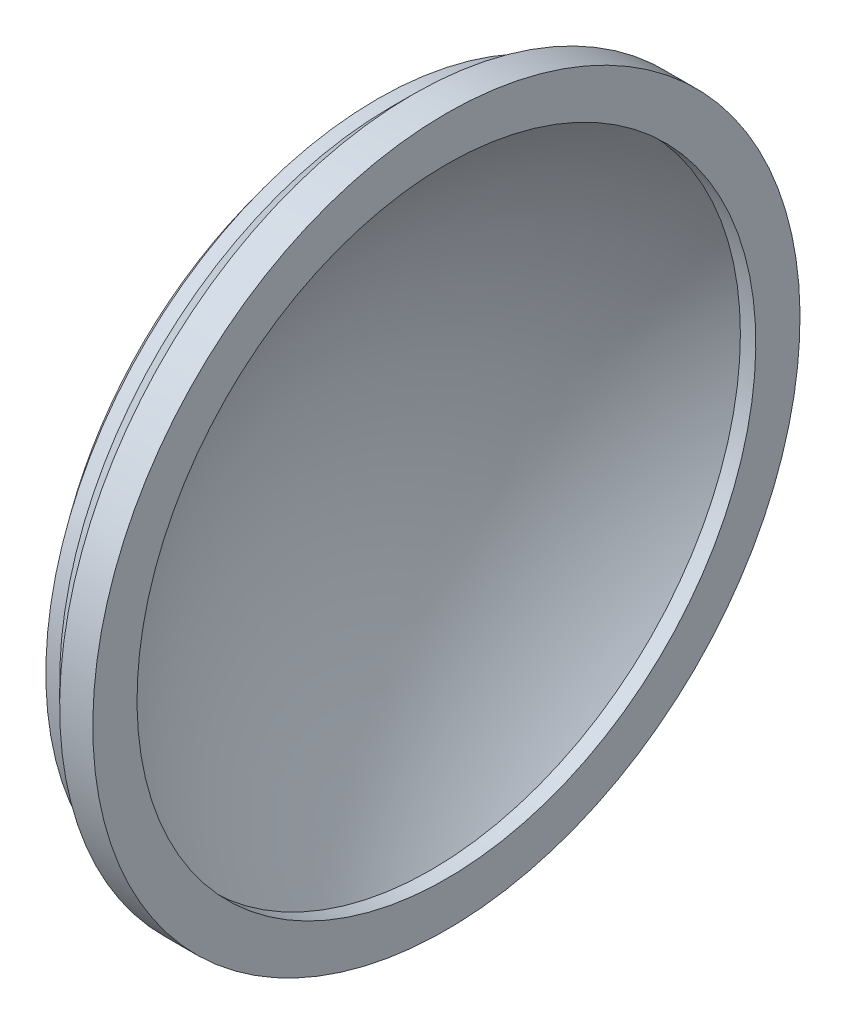
ISO-10303-21;
HEADER;
FILE_DESCRIPTION(('STEP AP214'),'2;1');
FILE_NAME('part.step','',(''),(''),'','','');
FILE_SCHEMA(('AUTOMOTIVE_DESIGN { 1 0 10303 214 1 1 1 1 }'));
ENDSEC;
DATA;
#1=APPLICATION_CONTEXT('core data for automotive mechanical design processes');
#2=APPLICATION_PROTOCOL_DEFINITION('international standard','automotive_design',2000,#1);
#3=PRODUCT_CONTEXT('',#1,'mechanical');
#4=PRODUCT('Part','Part','',(#3));
#5=PRODUCT_RELATED_PRODUCT_CATEGORY('part','',(#4));
#6=PRODUCT_DEFINITION_FORMATION('','',#4);
#7=PRODUCT_DEFINITION_CONTEXT('part definition',#1,'design');
#8=PRODUCT_DEFINITION('design','',#6,#7);
#9=PRODUCT_DEFINITION_SHAPE('','',#8);
#10=(LENGTH_UNIT() NAMED_UNIT(*) SI_UNIT(.MILLI.,.METRE.));
#11=(NAMED_UNIT(*) PLANE_ANGLE_UNIT() SI_UNIT($,.RADIAN.));
#12=(NAMED_UNIT(*) SI_UNIT($,.STERADIAN.) SOLID_ANGLE_UNIT());
#13=UNCERTAINTY_MEASURE_WITH_UNIT(LENGTH_MEASURE(1.E-05),#10,'distance_accuracy_value','');
#14=(GEOMETRIC_REPRESENTATION_CONTEXT(3) GLOBAL_UNCERTAINTY_ASSIGNED_CONTEXT((#13)) GLOBAL_UNIT_ASSIGNED_CONTEXT((#10,
#11,#12)) REPRESENTATION_CONTEXT('',''));
#15=CARTESIAN_POINT('',(0.,0.,0.));
#16=DIRECTION('',(0.,0.,1.));
#17=DIRECTION('',(1.,0.,0.));
#18=AXIS2_PLACEMENT_3D('',#15,#16,#17);
#19=CARTESIAN_POINT('',(45.1545993132813,0.,0.));
#20=DIRECTION('',(1.,0.,0.));
#21=DIRECTION('',(0.,-1.,0.));
#22=AXIS2_PLACEMENT_3D('',#19,#20,#21);
#23=SPHERICAL_SURFACE('',#22,85.);
#24=CARTESIAN_POINT('',(-18.7906898017114,0.,0.));
#25=DIRECTION('',(1.,0.,0.));
#26=DIRECTION('',(0.,1.,0.));
#27=AXIS2_PLACEMENT_3D('',#24,#25,#26);
#28=CIRCLE('',#27,56.);
#29=CARTESIAN_POINT('',(-18.7906898017114,56.,0.));
#30=VERTEX_POINT('',#29);
#31=EDGE_CURVE('E10',#30,#30,#28,.T.);
#32=ORIENTED_EDGE('',*,*,#31,.T.);
#33=EDGE_LOOP('',(#32));
#34=FACE_BOUND('',#33,.T.);
#35=ADVANCED_FACE('F31',(#34),#23,.F.);
#36=CARTESIAN_POINT('',(0.,0.,0.));
#37=DIRECTION('',(1.,0.,0.));
#38=DIRECTION('',(0.,1.,0.));
#39=AXIS2_PLACEMENT_3D('',#36,#37,#38);
#40=CYLINDRICAL_SURFACE('',#39,56.);
#41=CARTESIAN_POINT('',(-16.,0.,0.));
#42=DIRECTION('',(1.,0.,0.));
#43=DIRECTION('',(0.,1.,0.));
#44=AXIS2_PLACEMENT_3D('',#41,#42,#43);
#45=CIRCLE('',#44,56.);
#46=CARTESIAN_POINT('',(-16.,56.,0.));
#47=VERTEX_POINT('',#46);
#48=EDGE_CURVE('E37',#47,#47,#45,.T.);
#49=ORIENTED_EDGE('',*,*,#48,.T.);
#50=EDGE_LOOP('',(#49));
#51=FACE_BOUND('',#50,.T.);
#52=ORIENTED_EDGE('',*,*,#31,.F.);
#53=EDGE_LOOP('',(#52));
#54=FACE_BOUND('',#53,.T.);
#55=ADVANCED_FACE('F69',(#51,#54),#40,.F.);
#56=CARTESIAN_POINT('',(-16.,64.,0.));
#57=DIRECTION('',(1.,0.,0.));
#58=DIRECTION('',(0.,1.,0.));
#59=AXIS2_PLACEMENT_3D('',#56,#57,#58);
#60=PLANE('',#59);
#61=CARTESIAN_POINT('',(-16.,0.,0.));
#62=DIRECTION('',(1.,0.,0.));
#63=DIRECTION('',(0.,1.,0.));
#64=AXIS2_PLACEMENT_3D('',#61,#62,#63);
#65=CIRCLE('',#64,64.);
#66=CARTESIAN_POINT('',(-16.,64.,0.));
#67=VERTEX_POINT('',#66);
#68=EDGE_CURVE('E41',#67,#67,#65,.T.);
#69=ORIENTED_EDGE('',*,*,#68,.T.);
#70=EDGE_LOOP('',(#69));
#71=FACE_BOUND('',#70,.T.);
#72=ORIENTED_EDGE('',*,*,#48,.F.);
#73=EDGE_LOOP('',(#72));
#74=FACE_BOUND('',#73,.T.);
#75=ADVANCED_FACE('F73',(#71,#74),#60,.T.);
#76=CARTESIAN_POINT('',(0.,0.,0.));
#77=DIRECTION('',(1.,0.,0.));
#78=DIRECTION('',(0.,1.,0.));
#79=AXIS2_PLACEMENT_3D('',#76,#77,#78);
#80=CYLINDRICAL_SURFACE('',#79,64.);
#81=CARTESIAN_POINT('',(-22.,0.,0.));
#82=DIRECTION('',(1.,0.,0.));
#83=DIRECTION('',(0.,1.,0.));
#84=AXIS2_PLACEMENT_3D('',#81,#82,#83);
#85=CIRCLE('',#84,64.);
#86=CARTESIAN_POINT('',(-22.,64.,0.));
#87=VERTEX_POINT('',#86);
#88=EDGE_CURVE('E45',#87,#87,#85,.T.);
#89=ORIENTED_EDGE('',*,*,#88,.T.);
#90=EDGE_LOOP('',(#89));
#91=FACE_BOUND('',#90,.T.);
#92=ORIENTED_EDGE('',*,*,#68,.F.);
#93=EDGE_LOOP('',(#92));
#94=FACE_BOUND('',#93,.T.);
#95=ADVANCED_FACE('F77',(#91,#94),#80,.T.);
#96=CARTESIAN_POINT('',(-22.,0.,0.));
#97=DIRECTION('',(1.,0.,0.));
#98=DIRECTION('',(0.,1.,0.));
#99=AXIS2_PLACEMENT_3D('',#96,#97,#98);
#100=CONICAL_SURFACE('',#99,64.,0.785398163397466);
#101=CARTESIAN_POINT('',(-25.9999999999999,0.,0.));
#102=DIRECTION('',(1.,0.,0.));
#103=DIRECTION('',(0.,1.,0.));
#104=AXIS2_PLACEMENT_3D('',#101,#102,#103);
#105=CIRCLE('',#104,60.);
#106=CARTESIAN_POINT('',(-25.9999999999999,60.,0.));
#107=VERTEX_POINT('',#106);
#108=EDGE_CURVE('E50',#107,#107,#105,.T.);
#109=ORIENTED_EDGE('',*,*,#108,.T.);
#110=EDGE_LOOP('',(#109));
#111=FACE_BOUND('',#110,.T.);
#112=ORIENTED_EDGE('',*,*,#88,.F.);
#113=EDGE_LOOP('',(#112));
#114=FACE_BOUND('',#113,.T.);
#115=ADVANCED_FACE('F66',(#111,#114),#100,.T.);
#116=CARTESIAN_POINT('',(0.,0.,0.));
#117=DIRECTION('',(1.,0.,0.));
#118=DIRECTION('',(0.,1.,0.));
#119=AXIS2_PLACEMENT_3D('',#116,#117,#118);
#120=CYLINDRICAL_SURFACE('',#119,60.);
#121=CARTESIAN_POINT('',(-28.4999999999999,0.,0.));
#122=DIRECTION('',(1.,0.,0.));
#123=DIRECTION('',(0.,1.,0.));
#124=AXIS2_PLACEMENT_3D('',#121,#122,#123);
#125=CIRCLE('',#124,60.);
#126=CARTESIAN_POINT('',(-28.4999999999999,60.,0.));
#127=VERTEX_POINT('',#126);
#128=EDGE_CURVE('E53',#127,#127,#125,.T.);
#129=ORIENTED_EDGE('',*,*,#128,.T.);
#130=EDGE_LOOP('',(#129));
#131=FACE_BOUND('',#130,.T.);
#132=ORIENTED_EDGE('',*,*,#108,.F.);
#133=EDGE_LOOP('',(#132));
#134=FACE_BOUND('',#133,.T.);
#135=ADVANCED_FACE('F57',(#131,#134),#120,.T.);
#136=CARTESIAN_POINT('',(45.1545993132813,0.,0.));
#137=DIRECTION('',(1.,0.,0.));
#138=DIRECTION('',(0.,1.,0.));
#139=AXIS2_PLACEMENT_3D('',#136,#137,#138);
#140=SPHERICAL_SURFACE('',#139,95.);
#141=ORIENTED_EDGE('',*,*,#128,.F.);
#142=EDGE_LOOP('',(#141));
#143=FACE_BOUND('',#142,.T.);
#144=ADVANCED_FACE('F60',(#143),#140,.T.);
#145=CLOSED_SHELL('',(#35,#55,#75,#95,#115,#135,#144));
#146=MANIFOLD_SOLID_BREP('B2',#145);
#147=ADVANCED_BREP_SHAPE_REPRESENTATION('',(#18,#146),#14);
#148=SHAPE_DEFINITION_REPRESENTATION(#9,#147);
ENDSEC;
END-ISO-10303-21;
